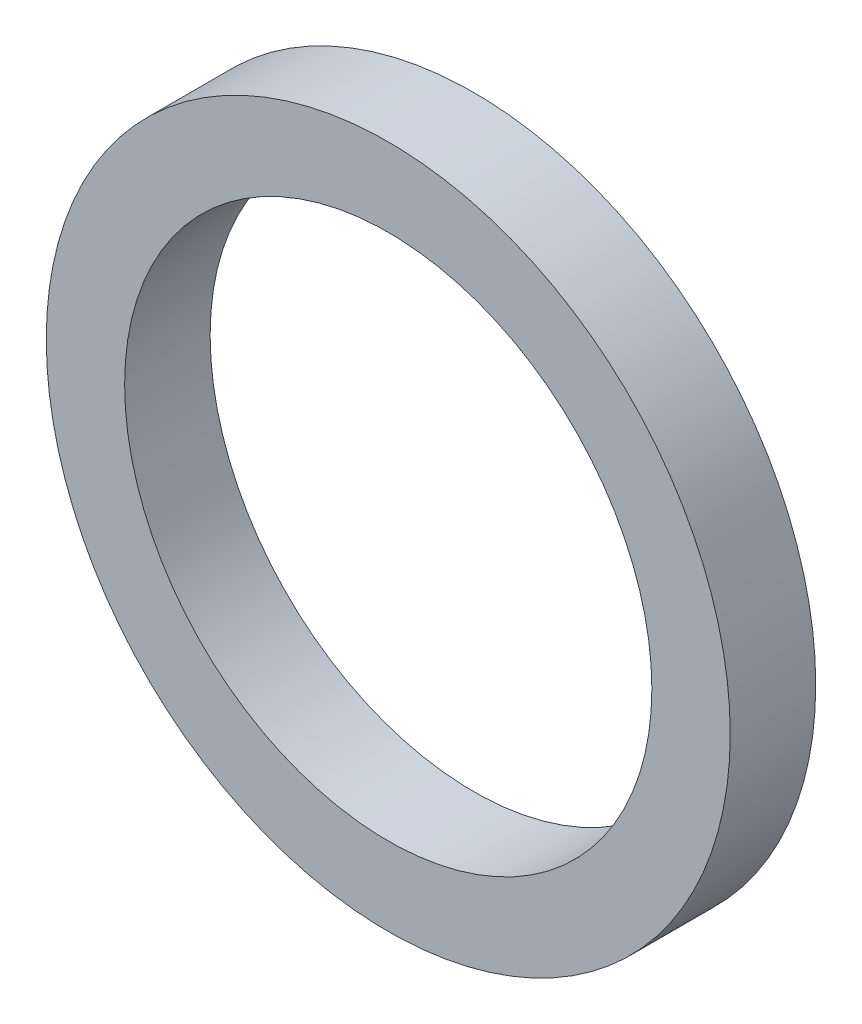
ISO-10303-21;
HEADER;
FILE_DESCRIPTION(('STEP AP214'),'2;1');
FILE_NAME('part.step','',(''),(''),'','','');
FILE_SCHEMA(('AUTOMOTIVE_DESIGN { 1 0 10303 214 1 1 1 1 }'));
ENDSEC;
DATA;
#1=APPLICATION_CONTEXT('core data for automotive mechanical design processes');
#2=APPLICATION_PROTOCOL_DEFINITION('international standard','automotive_design',2000,#1);
#3=PRODUCT_CONTEXT('',#1,'mechanical');
#4=PRODUCT('Part','Part','',(#3));
#5=PRODUCT_RELATED_PRODUCT_CATEGORY('part','',(#4));
#6=PRODUCT_DEFINITION_FORMATION('','',#4);
#7=PRODUCT_DEFINITION_CONTEXT('part definition',#1,'design');
#8=PRODUCT_DEFINITION('design','',#6,#7);
#9=PRODUCT_DEFINITION_SHAPE('','',#8);
#10=(LENGTH_UNIT() NAMED_UNIT(*) SI_UNIT(.MILLI.,.METRE.));
#11=(NAMED_UNIT(*) PLANE_ANGLE_UNIT() SI_UNIT($,.RADIAN.));
#12=(NAMED_UNIT(*) SI_UNIT($,.STERADIAN.) SOLID_ANGLE_UNIT());
#13=UNCERTAINTY_MEASURE_WITH_UNIT(LENGTH_MEASURE(1.E-05),#10,'distance_accuracy_value','');
#14=(GEOMETRIC_REPRESENTATION_CONTEXT(3) GLOBAL_UNCERTAINTY_ASSIGNED_CONTEXT((#13)) GLOBAL_UNIT_ASSIGNED_CONTEXT((#10,
#11,#12)) REPRESENTATION_CONTEXT('',''));
#15=CARTESIAN_POINT('',(0.,0.,0.));
#16=DIRECTION('',(0.,0.,1.));
#17=DIRECTION('',(1.,0.,0.));
#18=AXIS2_PLACEMENT_3D('',#15,#16,#17);
#19=CARTESIAN_POINT('',(0.,0.,3.));
#20=DIRECTION('',(0.,0.,1.));
#21=DIRECTION('',(1.,0.,0.));
#22=AXIS2_PLACEMENT_3D('',#19,#20,#21);
#23=PLANE('',#22);
#24=CARTESIAN_POINT('',(0.,0.,3.));
#25=DIRECTION('',(0.,0.,1.));
#26=DIRECTION('',(1.,0.,0.));
#27=AXIS2_PLACEMENT_3D('',#24,#25,#26);
#28=CIRCLE('',#27,12.);
#29=CARTESIAN_POINT('',(12.,0.,3.));
#30=VERTEX_POINT('',#29);
#31=EDGE_CURVE('E10',#30,#30,#28,.T.);
#32=ORIENTED_EDGE('',*,*,#31,.T.);
#33=EDGE_LOOP('',(#32));
#34=FACE_BOUND('',#33,.T.);
#35=CARTESIAN_POINT('',(0.,0.,3.));
#36=DIRECTION('',(0.,0.,1.));
#37=DIRECTION('',(1.,0.,0.));
#38=AXIS2_PLACEMENT_3D('',#35,#36,#37);
#39=CIRCLE('',#38,9.25);
#40=CARTESIAN_POINT('',(9.25,0.,3.));
#41=VERTEX_POINT('',#40);
#42=EDGE_CURVE('E50',#41,#41,#39,.T.);
#43=ORIENTED_EDGE('',*,*,#42,.F.);
#44=EDGE_LOOP('',(#43));
#45=FACE_BOUND('',#44,.T.);
#46=ADVANCED_FACE('F37',(#34,#45),#23,.T.);
#47=CARTESIAN_POINT('',(0.,0.,0.));
#48=DIRECTION('',(0.,0.,1.));
#49=DIRECTION('',(1.,0.,0.));
#50=AXIS2_PLACEMENT_3D('',#47,#48,#49);
#51=PLANE('',#50);
#52=CARTESIAN_POINT('',(0.,0.,0.));
#53=DIRECTION('',(0.,0.,1.));
#54=DIRECTION('',(1.,0.,0.));
#55=AXIS2_PLACEMENT_3D('',#52,#53,#54);
#56=CIRCLE('',#55,12.);
#57=CARTESIAN_POINT('',(12.,0.,0.));
#58=VERTEX_POINT('',#57);
#59=EDGE_CURVE('E41',#58,#58,#56,.T.);
#60=ORIENTED_EDGE('',*,*,#59,.F.);
#61=EDGE_LOOP('',(#60));
#62=FACE_BOUND('',#61,.T.);
#63=CARTESIAN_POINT('',(0.,0.,0.));
#64=DIRECTION('',(0.,0.,1.));
#65=DIRECTION('',(1.,0.,0.));
#66=AXIS2_PLACEMENT_3D('',#63,#64,#65);
#67=CIRCLE('',#66,9.25);
#68=CARTESIAN_POINT('',(9.25,0.,0.));
#69=VERTEX_POINT('',#68);
#70=EDGE_CURVE('E52',#69,#69,#67,.T.);
#71=ORIENTED_EDGE('',*,*,#70,.T.);
#72=EDGE_LOOP('',(#71));
#73=FACE_BOUND('',#72,.T.);
#74=ADVANCED_FACE('F64',(#62,#73),#51,.F.);
#75=CARTESIAN_POINT('',(0.,0.,3.));
#76=DIRECTION('',(0.,0.,-1.));
#77=DIRECTION('',(-1.,0.,0.));
#78=AXIS2_PLACEMENT_3D('',#75,#76,#77);
#79=CYLINDRICAL_SURFACE('',#78,12.);
#80=ORIENTED_EDGE('',*,*,#31,.F.);
#81=EDGE_LOOP('',(#80));
#82=FACE_BOUND('',#81,.T.);
#83=ORIENTED_EDGE('',*,*,#59,.T.);
#84=EDGE_LOOP('',(#83));
#85=FACE_BOUND('',#84,.T.);
#86=ADVANCED_FACE('F39',(#82,#85),#79,.T.);
#87=CARTESIAN_POINT('',(0.,0.,3.));
#88=DIRECTION('',(0.,0.,-1.));
#89=DIRECTION('',(-1.,0.,0.));
#90=AXIS2_PLACEMENT_3D('',#87,#88,#89);
#91=CYLINDRICAL_SURFACE('',#90,9.25);
#92=ORIENTED_EDGE('',*,*,#42,.T.);
#93=EDGE_LOOP('',(#92));
#94=FACE_BOUND('',#93,.T.);
#95=ORIENTED_EDGE('',*,*,#70,.F.);
#96=EDGE_LOOP('',(#95));
#97=FACE_BOUND('',#96,.T.);
#98=ADVANCED_FACE('F60',(#94,#97),#91,.F.);
#99=CLOSED_SHELL('',(#46,#74,#86,#98));
#100=MANIFOLD_SOLID_BREP('B2',#99);
#101=ADVANCED_BREP_SHAPE_REPRESENTATION('',(#18,#100),#14);
#102=SHAPE_DEFINITION_REPRESENTATION(#9,#101);
ENDSEC;
END-ISO-10303-21;
